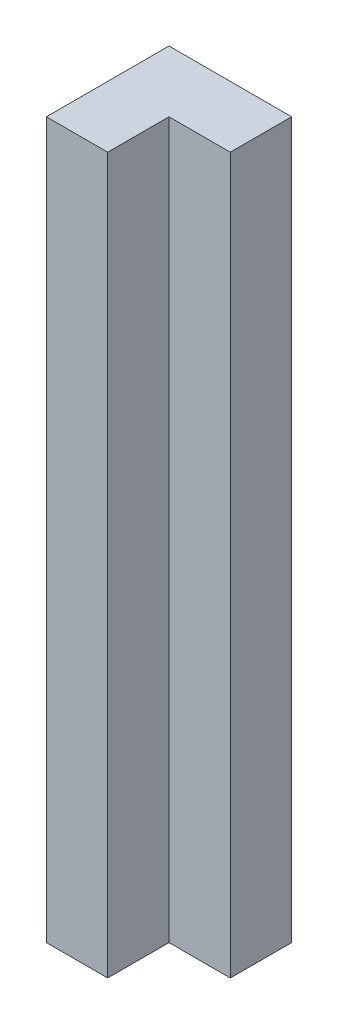
ISO-10303-21;
HEADER;
FILE_DESCRIPTION(('STEP AP214'),'2;1');
FILE_NAME('part.step','',(''),(''),'','','');
FILE_SCHEMA(('AUTOMOTIVE_DESIGN { 1 0 10303 214 1 1 1 1 }'));
ENDSEC;
DATA;
#1=APPLICATION_CONTEXT('core data for automotive mechanical design processes');
#2=APPLICATION_PROTOCOL_DEFINITION('international standard','automotive_design',2000,#1);
#3=PRODUCT_CONTEXT('',#1,'mechanical');
#4=PRODUCT('Part','Part','',(#3));
#5=PRODUCT_RELATED_PRODUCT_CATEGORY('part','',(#4));
#6=PRODUCT_DEFINITION_FORMATION('','',#4);
#7=PRODUCT_DEFINITION_CONTEXT('part definition',#1,'design');
#8=PRODUCT_DEFINITION('design','',#6,#7);
#9=PRODUCT_DEFINITION_SHAPE('','',#8);
#10=(LENGTH_UNIT() NAMED_UNIT(*) SI_UNIT(.MILLI.,.METRE.));
#11=(NAMED_UNIT(*) PLANE_ANGLE_UNIT() SI_UNIT($,.RADIAN.));
#12=(NAMED_UNIT(*) SI_UNIT($,.STERADIAN.) SOLID_ANGLE_UNIT());
#13=UNCERTAINTY_MEASURE_WITH_UNIT(LENGTH_MEASURE(1.E-05),#10,'distance_accuracy_value','');
#14=(GEOMETRIC_REPRESENTATION_CONTEXT(3) GLOBAL_UNCERTAINTY_ASSIGNED_CONTEXT((#13)) GLOBAL_UNIT_ASSIGNED_CONTEXT((#10,
#11,#12)) REPRESENTATION_CONTEXT('',''));
#15=CARTESIAN_POINT('',(0.,0.,0.));
#16=DIRECTION('',(0.,0.,1.));
#17=DIRECTION('',(1.,0.,0.));
#18=AXIS2_PLACEMENT_3D('',#15,#16,#17);
#19=CARTESIAN_POINT('',(6.,35.,0.));
#20=DIRECTION('',(0.,0.,1.));
#21=DIRECTION('',(1.,0.,0.));
#22=AXIS2_PLACEMENT_3D('',#19,#20,#21);
#23=PLANE('',#22);
#24=DIRECTION('',(-1.,0.,0.));
#25=VECTOR('',#24,1.);
#26=CARTESIAN_POINT('',(6.,0.,0.));
#27=LINE('',#26,#25);
#28=CARTESIAN_POINT('',(6.,0.,0.));
#29=VERTEX_POINT('',#28);
#30=CARTESIAN_POINT('',(0.,0.,0.));
#31=VERTEX_POINT('',#30);
#32=EDGE_CURVE('E117',#29,#31,#27,.T.);
#33=ORIENTED_EDGE('',*,*,#32,.T.);
#34=DIRECTION('',(0.,-1.,0.));
#35=VECTOR('',#34,1.);
#36=CARTESIAN_POINT('',(0.,35.,0.));
#37=LINE('',#36,#35);
#38=CARTESIAN_POINT('',(0.,35.,0.));
#39=VERTEX_POINT('',#38);
#40=EDGE_CURVE('E11',#39,#31,#37,.T.);
#41=ORIENTED_EDGE('',*,*,#40,.F.);
#42=DIRECTION('',(-1.,0.,0.));
#43=VECTOR('',#42,1.);
#44=CARTESIAN_POINT('',(6.,35.,0.));
#45=LINE('',#44,#43);
#46=CARTESIAN_POINT('',(6.,35.,0.));
#47=VERTEX_POINT('',#46);
#48=EDGE_CURVE('E127',#47,#39,#45,.T.);
#49=ORIENTED_EDGE('',*,*,#48,.F.);
#50=DIRECTION('',(0.,-1.,0.));
#51=VECTOR('',#50,1.);
#52=CARTESIAN_POINT('',(6.,35.,0.));
#53=LINE('',#52,#51);
#54=EDGE_CURVE('E113',#47,#29,#53,.T.);
#55=ORIENTED_EDGE('',*,*,#54,.T.);
#56=EDGE_LOOP('',(#33,#41,#49,#55));
#57=FACE_BOUND('',#56,.T.);
#58=ADVANCED_FACE('F33',(#57),#23,.F.);
#59=CARTESIAN_POINT('',(0.,35.,0.));
#60=DIRECTION('',(1.,0.,0.));
#61=DIRECTION('',(0.,0.,-1.));
#62=AXIS2_PLACEMENT_3D('',#59,#60,#61);
#63=PLANE('',#62);
#64=DIRECTION('',(0.,0.,1.));
#65=VECTOR('',#64,1.);
#66=CARTESIAN_POINT('',(0.,0.,0.));
#67=LINE('',#66,#65);
#68=CARTESIAN_POINT('',(0.,0.,6.));
#69=VERTEX_POINT('',#68);
#70=EDGE_CURVE('E120',#31,#69,#67,.T.);
#71=ORIENTED_EDGE('',*,*,#70,.T.);
#72=DIRECTION('',(0.,-1.,0.));
#73=VECTOR('',#72,1.);
#74=CARTESIAN_POINT('',(0.,35.,6.));
#75=LINE('',#74,#73);
#76=CARTESIAN_POINT('',(0.,35.,6.));
#77=VERTEX_POINT('',#76);
#78=EDGE_CURVE('E41',#77,#69,#75,.T.);
#79=ORIENTED_EDGE('',*,*,#78,.F.);
#80=DIRECTION('',(0.,0.,1.));
#81=VECTOR('',#80,1.);
#82=CARTESIAN_POINT('',(0.,35.,0.));
#83=LINE('',#82,#81);
#84=EDGE_CURVE('E86',#39,#77,#83,.T.);
#85=ORIENTED_EDGE('',*,*,#84,.F.);
#86=ORIENTED_EDGE('',*,*,#40,.T.);
#87=EDGE_LOOP('',(#71,#79,#85,#86));
#88=FACE_BOUND('',#87,.T.);
#89=ADVANCED_FACE('F151',(#88),#63,.F.);
#90=CARTESIAN_POINT('',(0.,35.,6.));
#91=DIRECTION('',(0.,0.,-1.));
#92=DIRECTION('',(-1.,0.,0.));
#93=AXIS2_PLACEMENT_3D('',#90,#91,#92);
#94=PLANE('',#93);
#95=DIRECTION('',(1.,0.,0.));
#96=VECTOR('',#95,1.);
#97=CARTESIAN_POINT('',(0.,0.,6.));
#98=LINE('',#97,#96);
#99=CARTESIAN_POINT('',(3.,0.,6.));
#100=VERTEX_POINT('',#99);
#101=EDGE_CURVE('E122',#69,#100,#98,.T.);
#102=ORIENTED_EDGE('',*,*,#101,.T.);
#103=DIRECTION('',(0.,-1.,0.));
#104=VECTOR('',#103,1.);
#105=CARTESIAN_POINT('',(3.,35.,6.));
#106=LINE('',#105,#104);
#107=CARTESIAN_POINT('',(3.,35.,6.));
#108=VERTEX_POINT('',#107);
#109=EDGE_CURVE('E108',#108,#100,#106,.T.);
#110=ORIENTED_EDGE('',*,*,#109,.F.);
#111=DIRECTION('',(1.,0.,0.));
#112=VECTOR('',#111,1.);
#113=CARTESIAN_POINT('',(0.,35.,6.));
#114=LINE('',#113,#112);
#115=EDGE_CURVE('E99',#77,#108,#114,.T.);
#116=ORIENTED_EDGE('',*,*,#115,.F.);
#117=ORIENTED_EDGE('',*,*,#78,.T.);
#118=EDGE_LOOP('',(#102,#110,#116,#117));
#119=FACE_BOUND('',#118,.T.);
#120=ADVANCED_FACE('F133',(#119),#94,.F.);
#121=CARTESIAN_POINT('',(3.,35.,6.));
#122=DIRECTION('',(-1.,0.,0.));
#123=DIRECTION('',(0.,0.,1.));
#124=AXIS2_PLACEMENT_3D('',#121,#122,#123);
#125=PLANE('',#124);
#126=DIRECTION('',(0.,0.,-1.));
#127=VECTOR('',#126,1.);
#128=CARTESIAN_POINT('',(3.,0.,6.));
#129=LINE('',#128,#127);
#130=CARTESIAN_POINT('',(3.,0.,3.));
#131=VERTEX_POINT('',#130);
#132=EDGE_CURVE('E107',#100,#131,#129,.T.);
#133=ORIENTED_EDGE('',*,*,#132,.T.);
#134=DIRECTION('',(0.,-1.,0.));
#135=VECTOR('',#134,1.);
#136=CARTESIAN_POINT('',(3.,35.,3.));
#137=LINE('',#136,#135);
#138=CARTESIAN_POINT('',(3.,35.,3.));
#139=VERTEX_POINT('',#138);
#140=EDGE_CURVE('E104',#139,#131,#137,.T.);
#141=ORIENTED_EDGE('',*,*,#140,.F.);
#142=DIRECTION('',(0.,0.,-1.));
#143=VECTOR('',#142,1.);
#144=CARTESIAN_POINT('',(3.,35.,6.));
#145=LINE('',#144,#143);
#146=EDGE_CURVE('E93',#108,#139,#145,.T.);
#147=ORIENTED_EDGE('',*,*,#146,.F.);
#148=ORIENTED_EDGE('',*,*,#109,.T.);
#149=EDGE_LOOP('',(#133,#141,#147,#148));
#150=FACE_BOUND('',#149,.T.);
#151=ADVANCED_FACE('F105',(#150),#125,.F.);
#152=CARTESIAN_POINT('',(3.,35.,3.));
#153=DIRECTION('',(0.,0.,-1.));
#154=DIRECTION('',(-1.,0.,0.));
#155=AXIS2_PLACEMENT_3D('',#152,#153,#154);
#156=PLANE('',#155);
#157=DIRECTION('',(1.,0.,0.));
#158=VECTOR('',#157,1.);
#159=CARTESIAN_POINT('',(3.,0.,3.));
#160=LINE('',#159,#158);
#161=CARTESIAN_POINT('',(6.,0.,3.));
#162=VERTEX_POINT('',#161);
#163=EDGE_CURVE('E72',#131,#162,#160,.T.);
#164=ORIENTED_EDGE('',*,*,#163,.T.);
#165=DIRECTION('',(0.,-1.,0.));
#166=VECTOR('',#165,1.);
#167=CARTESIAN_POINT('',(6.,35.,3.));
#168=LINE('',#167,#166);
#169=CARTESIAN_POINT('',(6.,35.,3.));
#170=VERTEX_POINT('',#169);
#171=EDGE_CURVE('E109',#170,#162,#168,.T.);
#172=ORIENTED_EDGE('',*,*,#171,.F.);
#173=DIRECTION('',(1.,0.,0.));
#174=VECTOR('',#173,1.);
#175=CARTESIAN_POINT('',(3.,35.,3.));
#176=LINE('',#175,#174);
#177=EDGE_CURVE('E97',#139,#170,#176,.T.);
#178=ORIENTED_EDGE('',*,*,#177,.F.);
#179=ORIENTED_EDGE('',*,*,#140,.T.);
#180=EDGE_LOOP('',(#164,#172,#178,#179));
#181=FACE_BOUND('',#180,.T.);
#182=ADVANCED_FACE('F111',(#181),#156,.F.);
#183=CARTESIAN_POINT('',(6.,35.,3.));
#184=DIRECTION('',(-1.,0.,0.));
#185=DIRECTION('',(0.,0.,1.));
#186=AXIS2_PLACEMENT_3D('',#183,#184,#185);
#187=PLANE('',#186);
#188=DIRECTION('',(0.,0.,-1.));
#189=VECTOR('',#188,1.);
#190=CARTESIAN_POINT('',(6.,0.,3.));
#191=LINE('',#190,#189);
#192=EDGE_CURVE('E78',#162,#29,#191,.T.);
#193=ORIENTED_EDGE('',*,*,#192,.T.);
#194=ORIENTED_EDGE('',*,*,#54,.F.);
#195=DIRECTION('',(0.,0.,-1.));
#196=VECTOR('',#195,1.);
#197=CARTESIAN_POINT('',(6.,35.,3.));
#198=LINE('',#197,#196);
#199=EDGE_CURVE('E49',#170,#47,#198,.T.);
#200=ORIENTED_EDGE('',*,*,#199,.F.);
#201=ORIENTED_EDGE('',*,*,#171,.T.);
#202=EDGE_LOOP('',(#193,#194,#200,#201));
#203=FACE_BOUND('',#202,.T.);
#204=ADVANCED_FACE('F140',(#203),#187,.F.);
#205=CARTESIAN_POINT('',(0.,35.,0.));
#206=DIRECTION('',(0.,1.,0.));
#207=DIRECTION('',(0.,0.,1.));
#208=AXIS2_PLACEMENT_3D('',#205,#206,#207);
#209=PLANE('',#208);
#210=ORIENTED_EDGE('',*,*,#48,.T.);
#211=ORIENTED_EDGE('',*,*,#84,.T.);
#212=ORIENTED_EDGE('',*,*,#115,.T.);
#213=ORIENTED_EDGE('',*,*,#146,.T.);
#214=ORIENTED_EDGE('',*,*,#177,.T.);
#215=ORIENTED_EDGE('',*,*,#199,.T.);
#216=EDGE_LOOP('',(#210,#211,#212,#213,#214,#215));
#217=FACE_BOUND('',#216,.T.);
#218=ADVANCED_FACE('F95',(#217),#209,.T.);
#219=CARTESIAN_POINT('',(0.,0.,0.));
#220=DIRECTION('',(0.,1.,0.));
#221=DIRECTION('',(0.,0.,1.));
#222=AXIS2_PLACEMENT_3D('',#219,#220,#221);
#223=PLANE('',#222);
#224=ORIENTED_EDGE('',*,*,#32,.F.);
#225=ORIENTED_EDGE('',*,*,#192,.F.);
#226=ORIENTED_EDGE('',*,*,#163,.F.);
#227=ORIENTED_EDGE('',*,*,#132,.F.);
#228=ORIENTED_EDGE('',*,*,#101,.F.);
#229=ORIENTED_EDGE('',*,*,#70,.F.);
#230=EDGE_LOOP('',(#224,#225,#226,#227,#228,#229));
#231=FACE_BOUND('',#230,.T.);
#232=ADVANCED_FACE('F136',(#231),#223,.F.);
#233=CLOSED_SHELL('',(#58,#89,#120,#151,#182,#204,#218,#232));
#234=MANIFOLD_SOLID_BREP('B2',#233);
#235=ADVANCED_BREP_SHAPE_REPRESENTATION('',(#18,#234),#14);
#236=SHAPE_DEFINITION_REPRESENTATION(#9,#235);
ENDSEC;
END-ISO-10303-21;
